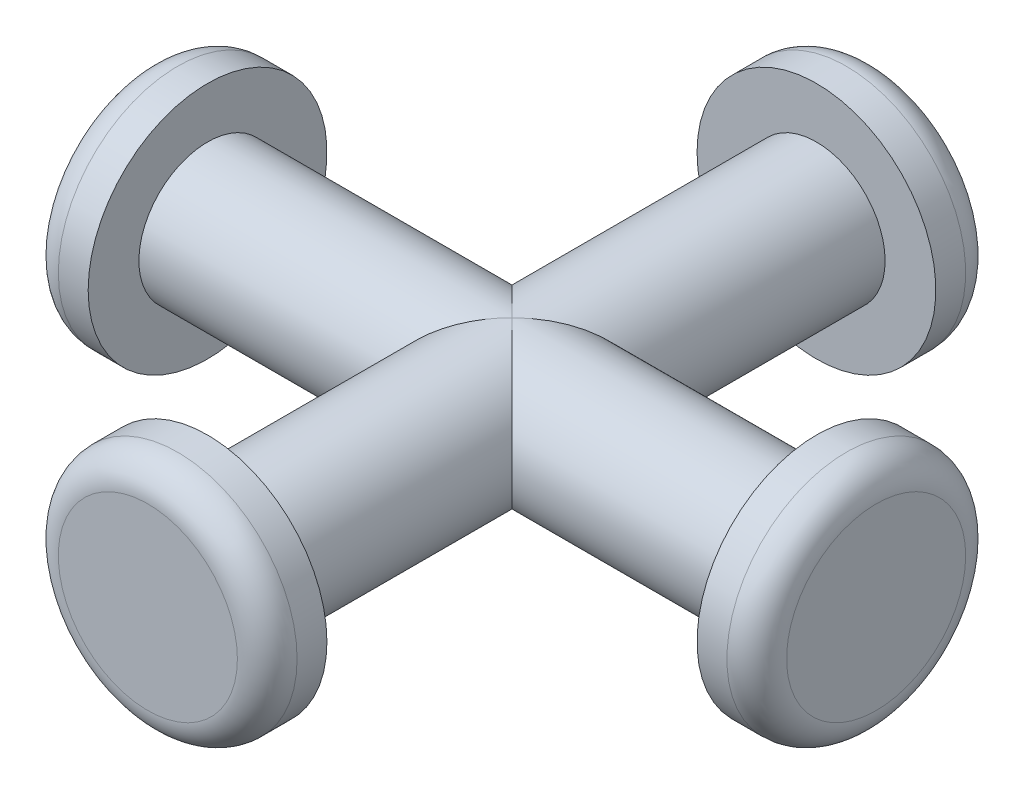
ISO-10303-21;
HEADER;
FILE_DESCRIPTION(('STEP AP214'),'2;1');
FILE_NAME('part.step','',(''),(''),'','','');
FILE_SCHEMA(('AUTOMOTIVE_DESIGN { 1 0 10303 214 1 1 1 1 }'));
ENDSEC;
DATA;
#1=APPLICATION_CONTEXT('core data for automotive mechanical design processes');
#2=APPLICATION_PROTOCOL_DEFINITION('international standard','automotive_design',2000,#1);
#3=PRODUCT_CONTEXT('',#1,'mechanical');
#4=PRODUCT('Part','Part','',(#3));
#5=PRODUCT_RELATED_PRODUCT_CATEGORY('part','',(#4));
#6=PRODUCT_DEFINITION_FORMATION('','',#4);
#7=PRODUCT_DEFINITION_CONTEXT('part definition',#1,'design');
#8=PRODUCT_DEFINITION('design','',#6,#7);
#9=PRODUCT_DEFINITION_SHAPE('','',#8);
#10=(LENGTH_UNIT() NAMED_UNIT(*) SI_UNIT(.MILLI.,.METRE.));
#11=(NAMED_UNIT(*) PLANE_ANGLE_UNIT() SI_UNIT($,.RADIAN.));
#12=(NAMED_UNIT(*) SI_UNIT($,.STERADIAN.) SOLID_ANGLE_UNIT());
#13=UNCERTAINTY_MEASURE_WITH_UNIT(LENGTH_MEASURE(1.E-05),#10,'distance_accuracy_value','');
#14=(GEOMETRIC_REPRESENTATION_CONTEXT(3) GLOBAL_UNCERTAINTY_ASSIGNED_CONTEXT((#13)) GLOBAL_UNIT_ASSIGNED_CONTEXT((#10,
#11,#12)) REPRESENTATION_CONTEXT('',''));
#15=CARTESIAN_POINT('',(0.,0.,0.));
#16=DIRECTION('',(0.,0.,1.));
#17=DIRECTION('',(1.,0.,0.));
#18=AXIS2_PLACEMENT_3D('',#15,#16,#17);
#19=CARTESIAN_POINT('',(0.,0.,10.2));
#20=DIRECTION('',(0.,0.,-1.));
#21=DIRECTION('',(-1.,0.,0.));
#22=AXIS2_PLACEMENT_3D('',#19,#20,#21);
#23=CYLINDRICAL_SURFACE('',#22,2.3);
#24=CARTESIAN_POINT('',(0.,0.,10.2));
#25=DIRECTION('',(0.,0.,1.));
#26=DIRECTION('',(1.,0.,0.));
#27=AXIS2_PLACEMENT_3D('',#24,#25,#26);
#28=CIRCLE('',#27,2.3);
#29=CARTESIAN_POINT('',(2.3,0.,10.2));
#30=VERTEX_POINT('',#29);
#31=EDGE_CURVE('E61',#30,#30,#28,.T.);
#32=ORIENTED_EDGE('',*,*,#31,.F.);
#33=EDGE_LOOP('',(#32));
#34=FACE_BOUND('',#33,.T.);
#35=CARTESIAN_POINT('',(0.,0.,0.));
#36=DIRECTION('',(-0.707106781186547,0.,-0.707106781186547));
#37=DIRECTION('',(0.707106781186547,0.,-0.707106781186547));
#38=AXIS2_PLACEMENT_3D('',#35,#36,#37);
#39=ELLIPSE('',#38,3.25269119345812,2.3);
#40=CARTESIAN_POINT('',(0.,-2.3,0.));
#41=VERTEX_POINT('',#40);
#42=CARTESIAN_POINT('',(0.,2.3,0.));
#43=VERTEX_POINT('',#42);
#44=EDGE_CURVE('E54',#41,#43,#39,.T.);
#45=ORIENTED_EDGE('',*,*,#44,.F.);
#46=CARTESIAN_POINT('',(0.,0.,0.));
#47=DIRECTION('',(0.707106781186547,0.,-0.707106781186547));
#48=DIRECTION('',(-0.707106781186547,0.,-0.707106781186547));
#49=AXIS2_PLACEMENT_3D('',#46,#47,#48);
#50=ELLIPSE('',#49,3.25269119345812,2.3);
#51=EDGE_CURVE('E53',#43,#41,#50,.T.);
#52=ORIENTED_EDGE('',*,*,#51,.F.);
#53=EDGE_LOOP('',(#45,#52));
#54=FACE_BOUND('',#53,.T.);
#55=ADVANCED_FACE('F33',(#34,#54),#23,.T.);
#56=CARTESIAN_POINT('',(10.2,0.,0.));
#57=DIRECTION('',(-1.,0.,0.));
#58=DIRECTION('',(0.,0.,1.));
#59=AXIS2_PLACEMENT_3D('',#56,#57,#58);
#60=CYLINDRICAL_SURFACE('',#59,2.3);
#61=CARTESIAN_POINT('',(-10.2,0.,0.));
#62=DIRECTION('',(1.,0.,0.));
#63=DIRECTION('',(0.,0.,-1.));
#64=AXIS2_PLACEMENT_3D('',#61,#62,#63);
#65=CIRCLE('',#64,2.3);
#66=CARTESIAN_POINT('',(-10.2,0.,-2.3));
#67=VERTEX_POINT('',#66);
#68=EDGE_CURVE('E132',#67,#67,#65,.T.);
#69=ORIENTED_EDGE('',*,*,#68,.T.);
#70=EDGE_LOOP('',(#69));
#71=FACE_BOUND('',#70,.T.);
#72=CARTESIAN_POINT('',(0.,0.,0.));
#73=DIRECTION('',(0.707106781186547,0.,-0.707106781186547));
#74=DIRECTION('',(-0.707106781186547,0.,-0.707106781186547));
#75=AXIS2_PLACEMENT_3D('',#72,#73,#74);
#76=ELLIPSE('',#75,3.25269119345812,2.3);
#77=EDGE_CURVE('E47',#43,#41,#76,.F.);
#78=ORIENTED_EDGE('',*,*,#77,.T.);
#79=ORIENTED_EDGE('',*,*,#44,.T.);
#80=EDGE_LOOP('',(#78,#79));
#81=FACE_BOUND('',#80,.T.);
#82=ADVANCED_FACE('F63',(#71,#81),#60,.T.);
#83=CARTESIAN_POINT('',(0.,0.,-10.2));
#84=DIRECTION('',(0.,0.,1.));
#85=DIRECTION('',(1.,0.,0.));
#86=AXIS2_PLACEMENT_3D('',#83,#84,#85);
#87=CIRCLE('',#86,2.3);
#88=CARTESIAN_POINT('',(2.3,0.,-10.2));
#89=VERTEX_POINT('',#88);
#90=EDGE_CURVE('E118',#89,#89,#87,.T.);
#91=ORIENTED_EDGE('',*,*,#90,.T.);
#92=EDGE_LOOP('',(#91));
#93=FACE_BOUND('',#92,.T.);
#94=CARTESIAN_POINT('',(0.,0.,0.));
#95=DIRECTION('',(-0.707106781186547,0.,-0.707106781186547));
#96=DIRECTION('',(0.707106781186547,0.,-0.707106781186547));
#97=AXIS2_PLACEMENT_3D('',#94,#95,#96);
#98=ELLIPSE('',#97,3.25269119345812,2.3);
#99=EDGE_CURVE('E60',#41,#43,#98,.F.);
#100=ORIENTED_EDGE('',*,*,#99,.F.);
#101=ORIENTED_EDGE('',*,*,#77,.F.);
#102=EDGE_LOOP('',(#100,#101));
#103=FACE_BOUND('',#102,.T.);
#104=ADVANCED_FACE('F59',(#93,#103),#23,.T.);
#105=CARTESIAN_POINT('',(10.2,0.,0.));
#106=DIRECTION('',(1.,0.,0.));
#107=DIRECTION('',(0.,0.,-1.));
#108=AXIS2_PLACEMENT_3D('',#105,#106,#107);
#109=CIRCLE('',#108,2.3);
#110=CARTESIAN_POINT('',(10.2,0.,-2.3));
#111=VERTEX_POINT('',#110);
#112=EDGE_CURVE('E131',#111,#111,#109,.T.);
#113=ORIENTED_EDGE('',*,*,#112,.F.);
#114=EDGE_LOOP('',(#113));
#115=FACE_BOUND('',#114,.T.);
#116=ORIENTED_EDGE('',*,*,#51,.T.);
#117=ORIENTED_EDGE('',*,*,#99,.T.);
#118=EDGE_LOOP('',(#116,#117));
#119=FACE_BOUND('',#118,.T.);
#120=ADVANCED_FACE('F65',(#115,#119),#60,.T.);
#121=CARTESIAN_POINT('',(12.2,0.,0.));
#122=DIRECTION('',(-1.,0.,0.));
#123=DIRECTION('',(0.,0.,1.));
#124=AXIS2_PLACEMENT_3D('',#121,#122,#123);
#125=CYLINDRICAL_SURFACE('',#124,4.);
#126=CARTESIAN_POINT('',(11.2,0.,0.));
#127=DIRECTION('',(1.,0.,0.));
#128=DIRECTION('',(0.,0.,-1.));
#129=AXIS2_PLACEMENT_3D('',#126,#127,#128);
#130=CIRCLE('',#129,4.);
#131=CARTESIAN_POINT('',(11.2,0.,-4.));
#132=VERTEX_POINT('',#131);
#133=EDGE_CURVE('E83',#132,#132,#130,.F.);
#134=ORIENTED_EDGE('',*,*,#133,.T.);
#135=EDGE_LOOP('',(#134));
#136=FACE_BOUND('',#135,.T.);
#137=CARTESIAN_POINT('',(10.2,0.,0.));
#138=DIRECTION('',(1.,0.,0.));
#139=DIRECTION('',(0.,0.,-1.));
#140=AXIS2_PLACEMENT_3D('',#137,#138,#139);
#141=CIRCLE('',#140,4.);
#142=CARTESIAN_POINT('',(10.2,0.,-4.));
#143=VERTEX_POINT('',#142);
#144=EDGE_CURVE('E135',#143,#143,#141,.T.);
#145=ORIENTED_EDGE('',*,*,#144,.T.);
#146=EDGE_LOOP('',(#145));
#147=FACE_BOUND('',#146,.T.);
#148=ADVANCED_FACE('F114',(#136,#147),#125,.T.);
#149=CARTESIAN_POINT('',(12.2,0.,0.));
#150=DIRECTION('',(1.,0.,0.));
#151=DIRECTION('',(0.,0.,-1.));
#152=AXIS2_PLACEMENT_3D('',#149,#150,#151);
#153=PLANE('',#152);
#154=CARTESIAN_POINT('',(12.2,0.,0.));
#155=DIRECTION('',(1.,0.,0.));
#156=DIRECTION('',(0.,0.,-1.));
#157=AXIS2_PLACEMENT_3D('',#154,#155,#156);
#158=CIRCLE('',#157,3.);
#159=CARTESIAN_POINT('',(12.2,0.,-3.));
#160=VERTEX_POINT('',#159);
#161=EDGE_CURVE('E80',#160,#160,#158,.T.);
#162=ORIENTED_EDGE('',*,*,#161,.T.);
#163=EDGE_LOOP('',(#162));
#164=FACE_BOUND('',#163,.T.);
#165=ADVANCED_FACE('F165',(#164),#153,.T.);
#166=CARTESIAN_POINT('',(10.2,0.,0.));
#167=DIRECTION('',(1.,0.,0.));
#168=DIRECTION('',(0.,0.,-1.));
#169=AXIS2_PLACEMENT_3D('',#166,#167,#168);
#170=PLANE('',#169);
#171=ORIENTED_EDGE('',*,*,#112,.T.);
#172=EDGE_LOOP('',(#171));
#173=FACE_BOUND('',#172,.T.);
#174=ORIENTED_EDGE('',*,*,#144,.F.);
#175=EDGE_LOOP('',(#174));
#176=FACE_BOUND('',#175,.T.);
#177=ADVANCED_FACE('F163',(#173,#176),#170,.F.);
#178=CARTESIAN_POINT('',(-12.2,0.,0.));
#179=DIRECTION('',(1.,0.,0.));
#180=DIRECTION('',(0.,0.,-1.));
#181=AXIS2_PLACEMENT_3D('',#178,#179,#180);
#182=CYLINDRICAL_SURFACE('',#181,4.);
#183=CARTESIAN_POINT('',(-11.2,0.,0.));
#184=DIRECTION('',(-1.,0.,0.));
#185=DIRECTION('',(0.,0.,1.));
#186=AXIS2_PLACEMENT_3D('',#183,#184,#185);
#187=CIRCLE('',#186,4.);
#188=CARTESIAN_POINT('',(-11.2,0.,4.));
#189=VERTEX_POINT('',#188);
#190=EDGE_CURVE('E69',#189,#189,#187,.F.);
#191=ORIENTED_EDGE('',*,*,#190,.T.);
#192=EDGE_LOOP('',(#191));
#193=FACE_BOUND('',#192,.T.);
#194=CARTESIAN_POINT('',(-10.2,0.,0.));
#195=DIRECTION('',(-1.,0.,0.));
#196=DIRECTION('',(0.,0.,1.));
#197=AXIS2_PLACEMENT_3D('',#194,#195,#196);
#198=CIRCLE('',#197,4.);
#199=CARTESIAN_POINT('',(-10.2,0.,4.));
#200=VERTEX_POINT('',#199);
#201=EDGE_CURVE('E124',#200,#200,#198,.T.);
#202=ORIENTED_EDGE('',*,*,#201,.T.);
#203=EDGE_LOOP('',(#202));
#204=FACE_BOUND('',#203,.T.);
#205=ADVANCED_FACE('F143',(#193,#204),#182,.T.);
#206=CARTESIAN_POINT('',(-12.2,0.,0.));
#207=DIRECTION('',(-1.,0.,0.));
#208=DIRECTION('',(0.,0.,1.));
#209=AXIS2_PLACEMENT_3D('',#206,#207,#208);
#210=PLANE('',#209);
#211=CARTESIAN_POINT('',(-12.2,0.,0.));
#212=DIRECTION('',(-1.,0.,0.));
#213=DIRECTION('',(0.,0.,1.));
#214=AXIS2_PLACEMENT_3D('',#211,#212,#213);
#215=CIRCLE('',#214,3.);
#216=CARTESIAN_POINT('',(-12.2,0.,3.));
#217=VERTEX_POINT('',#216);
#218=EDGE_CURVE('E66',#217,#217,#215,.T.);
#219=ORIENTED_EDGE('',*,*,#218,.T.);
#220=EDGE_LOOP('',(#219));
#221=FACE_BOUND('',#220,.T.);
#222=ADVANCED_FACE('F148',(#221),#210,.T.);
#223=CARTESIAN_POINT('',(-10.2,0.,0.));
#224=DIRECTION('',(-1.,0.,0.));
#225=DIRECTION('',(0.,0.,1.));
#226=AXIS2_PLACEMENT_3D('',#223,#224,#225);
#227=PLANE('',#226);
#228=ORIENTED_EDGE('',*,*,#68,.F.);
#229=EDGE_LOOP('',(#228));
#230=FACE_BOUND('',#229,.T.);
#231=ORIENTED_EDGE('',*,*,#201,.F.);
#232=EDGE_LOOP('',(#231));
#233=FACE_BOUND('',#232,.T.);
#234=ADVANCED_FACE('F145',(#230,#233),#227,.F.);
#235=CARTESIAN_POINT('',(0.,0.,12.2));
#236=DIRECTION('',(0.,0.,-1.));
#237=DIRECTION('',(-1.,0.,0.));
#238=AXIS2_PLACEMENT_3D('',#235,#236,#237);
#239=CYLINDRICAL_SURFACE('',#238,4.);
#240=CARTESIAN_POINT('',(0.,0.,11.2));
#241=DIRECTION('',(0.,0.,1.));
#242=DIRECTION('',(1.,0.,0.));
#243=AXIS2_PLACEMENT_3D('',#240,#241,#242);
#244=CIRCLE('',#243,4.);
#245=CARTESIAN_POINT('',(4.,0.,11.2));
#246=VERTEX_POINT('',#245);
#247=EDGE_CURVE('E11',#246,#246,#244,.F.);
#248=ORIENTED_EDGE('',*,*,#247,.T.);
#249=EDGE_LOOP('',(#248));
#250=FACE_BOUND('',#249,.T.);
#251=CARTESIAN_POINT('',(0.,0.,10.2));
#252=DIRECTION('',(0.,0.,1.));
#253=DIRECTION('',(1.,0.,0.));
#254=AXIS2_PLACEMENT_3D('',#251,#252,#253);
#255=CIRCLE('',#254,4.);
#256=CARTESIAN_POINT('',(4.,0.,10.2));
#257=VERTEX_POINT('',#256);
#258=EDGE_CURVE('E120',#257,#257,#255,.T.);
#259=ORIENTED_EDGE('',*,*,#258,.T.);
#260=EDGE_LOOP('',(#259));
#261=FACE_BOUND('',#260,.T.);
#262=ADVANCED_FACE('F147',(#250,#261),#239,.T.);
#263=CARTESIAN_POINT('',(0.,0.,12.2));
#264=DIRECTION('',(0.,0.,1.));
#265=DIRECTION('',(1.,0.,0.));
#266=AXIS2_PLACEMENT_3D('',#263,#264,#265);
#267=PLANE('',#266);
#268=CARTESIAN_POINT('',(0.,0.,12.2));
#269=DIRECTION('',(0.,0.,1.));
#270=DIRECTION('',(1.,0.,0.));
#271=AXIS2_PLACEMENT_3D('',#268,#269,#270);
#272=CIRCLE('',#271,3.);
#273=CARTESIAN_POINT('',(3.,0.,12.2));
#274=VERTEX_POINT('',#273);
#275=EDGE_CURVE('E41',#274,#274,#272,.T.);
#276=ORIENTED_EDGE('',*,*,#275,.T.);
#277=EDGE_LOOP('',(#276));
#278=FACE_BOUND('',#277,.T.);
#279=ADVANCED_FACE('F88',(#278),#267,.T.);
#280=CARTESIAN_POINT('',(0.,0.,10.2));
#281=DIRECTION('',(0.,0.,1.));
#282=DIRECTION('',(1.,0.,0.));
#283=AXIS2_PLACEMENT_3D('',#280,#281,#282);
#284=PLANE('',#283);
#285=ORIENTED_EDGE('',*,*,#31,.T.);
#286=EDGE_LOOP('',(#285));
#287=FACE_BOUND('',#286,.T.);
#288=ORIENTED_EDGE('',*,*,#258,.F.);
#289=EDGE_LOOP('',(#288));
#290=FACE_BOUND('',#289,.T.);
#291=ADVANCED_FACE('F217',(#287,#290),#284,.F.);
#292=CARTESIAN_POINT('',(0.,0.,-12.2));
#293=DIRECTION('',(0.,0.,1.));
#294=DIRECTION('',(1.,0.,0.));
#295=AXIS2_PLACEMENT_3D('',#292,#293,#294);
#296=CYLINDRICAL_SURFACE('',#295,4.);
#297=CARTESIAN_POINT('',(0.,0.,-11.2));
#298=DIRECTION('',(0.,0.,-1.));
#299=DIRECTION('',(-1.,0.,0.));
#300=AXIS2_PLACEMENT_3D('',#297,#298,#299);
#301=CIRCLE('',#300,4.);
#302=CARTESIAN_POINT('',(-4.,0.,-11.2));
#303=VERTEX_POINT('',#302);
#304=EDGE_CURVE('E77',#303,#303,#301,.F.);
#305=ORIENTED_EDGE('',*,*,#304,.T.);
#306=EDGE_LOOP('',(#305));
#307=FACE_BOUND('',#306,.T.);
#308=CARTESIAN_POINT('',(0.,0.,-10.2));
#309=DIRECTION('',(0.,0.,-1.));
#310=DIRECTION('',(-1.,0.,0.));
#311=AXIS2_PLACEMENT_3D('',#308,#309,#310);
#312=CIRCLE('',#311,4.);
#313=CARTESIAN_POINT('',(-4.,0.,-10.2));
#314=VERTEX_POINT('',#313);
#315=EDGE_CURVE('E121',#314,#314,#312,.T.);
#316=ORIENTED_EDGE('',*,*,#315,.T.);
#317=EDGE_LOOP('',(#316));
#318=FACE_BOUND('',#317,.T.);
#319=ADVANCED_FACE('F224',(#307,#318),#296,.T.);
#320=CARTESIAN_POINT('',(0.,0.,-12.2));
#321=DIRECTION('',(0.,0.,-1.));
#322=DIRECTION('',(-1.,0.,0.));
#323=AXIS2_PLACEMENT_3D('',#320,#321,#322);
#324=PLANE('',#323);
#325=CARTESIAN_POINT('',(0.,0.,-12.2));
#326=DIRECTION('',(0.,0.,-1.));
#327=DIRECTION('',(-1.,0.,0.));
#328=AXIS2_PLACEMENT_3D('',#325,#326,#327);
#329=CIRCLE('',#328,3.);
#330=CARTESIAN_POINT('',(-3.,0.,-12.2));
#331=VERTEX_POINT('',#330);
#332=EDGE_CURVE('E74',#331,#331,#329,.T.);
#333=ORIENTED_EDGE('',*,*,#332,.T.);
#334=EDGE_LOOP('',(#333));
#335=FACE_BOUND('',#334,.T.);
#336=ADVANCED_FACE('F229',(#335),#324,.T.);
#337=CARTESIAN_POINT('',(0.,0.,-10.2));
#338=DIRECTION('',(0.,0.,-1.));
#339=DIRECTION('',(-1.,0.,0.));
#340=AXIS2_PLACEMENT_3D('',#337,#338,#339);
#341=PLANE('',#340);
#342=ORIENTED_EDGE('',*,*,#90,.F.);
#343=EDGE_LOOP('',(#342));
#344=FACE_BOUND('',#343,.T.);
#345=ORIENTED_EDGE('',*,*,#315,.F.);
#346=EDGE_LOOP('',(#345));
#347=FACE_BOUND('',#346,.T.);
#348=ADVANCED_FACE('F239',(#344,#347),#341,.F.);
#349=CARTESIAN_POINT('',(-11.2,0.,0.));
#350=DIRECTION('',(-1.,0.,0.));
#351=DIRECTION('',(0.,0.,1.));
#352=AXIS2_PLACEMENT_3D('',#349,#350,#351);
#353=TOROIDAL_SURFACE('',#352,3.,1.);
#354=ORIENTED_EDGE('',*,*,#190,.F.);
#355=EDGE_LOOP('',(#354));
#356=FACE_BOUND('',#355,.T.);
#357=ORIENTED_EDGE('',*,*,#218,.F.);
#358=EDGE_LOOP('',(#357));
#359=FACE_BOUND('',#358,.T.);
#360=ADVANCED_FACE('F247',(#356,#359),#353,.T.);
#361=CARTESIAN_POINT('',(0.,0.,-11.2));
#362=DIRECTION('',(0.,0.,-1.));
#363=DIRECTION('',(-1.,0.,0.));
#364=AXIS2_PLACEMENT_3D('',#361,#362,#363);
#365=TOROIDAL_SURFACE('',#364,3.,1.);
#366=ORIENTED_EDGE('',*,*,#304,.F.);
#367=EDGE_LOOP('',(#366));
#368=FACE_BOUND('',#367,.T.);
#369=ORIENTED_EDGE('',*,*,#332,.F.);
#370=EDGE_LOOP('',(#369));
#371=FACE_BOUND('',#370,.T.);
#372=ADVANCED_FACE('F96',(#368,#371),#365,.T.);
#373=CARTESIAN_POINT('',(11.2,0.,0.));
#374=DIRECTION('',(1.,0.,0.));
#375=DIRECTION('',(0.,0.,-1.));
#376=AXIS2_PLACEMENT_3D('',#373,#374,#375);
#377=TOROIDAL_SURFACE('',#376,3.,1.);
#378=ORIENTED_EDGE('',*,*,#133,.F.);
#379=EDGE_LOOP('',(#378));
#380=FACE_BOUND('',#379,.T.);
#381=ORIENTED_EDGE('',*,*,#161,.F.);
#382=EDGE_LOOP('',(#381));
#383=FACE_BOUND('',#382,.T.);
#384=ADVANCED_FACE('F91',(#380,#383),#377,.T.);
#385=CARTESIAN_POINT('',(0.,0.,11.2));
#386=DIRECTION('',(0.,0.,1.));
#387=DIRECTION('',(1.,0.,0.));
#388=AXIS2_PLACEMENT_3D('',#385,#386,#387);
#389=TOROIDAL_SURFACE('',#388,3.,1.);
#390=ORIENTED_EDGE('',*,*,#247,.F.);
#391=EDGE_LOOP('',(#390));
#392=FACE_BOUND('',#391,.T.);
#393=ORIENTED_EDGE('',*,*,#275,.F.);
#394=EDGE_LOOP('',(#393));
#395=FACE_BOUND('',#394,.T.);
#396=ADVANCED_FACE('F35',(#392,#395),#389,.T.);
#397=CLOSED_SHELL('',(#55,#82,#104,#120,#148,#165,#177,#205,#222,#234,#262,#279,#291,#319,#336,
#348,#360,#372,#384,#396));
#398=MANIFOLD_SOLID_BREP('B2',#397);
#399=ADVANCED_BREP_SHAPE_REPRESENTATION('',(#18,#398),#14);
#400=SHAPE_DEFINITION_REPRESENTATION(#9,#399);
ENDSEC;
END-ISO-10303-21;
